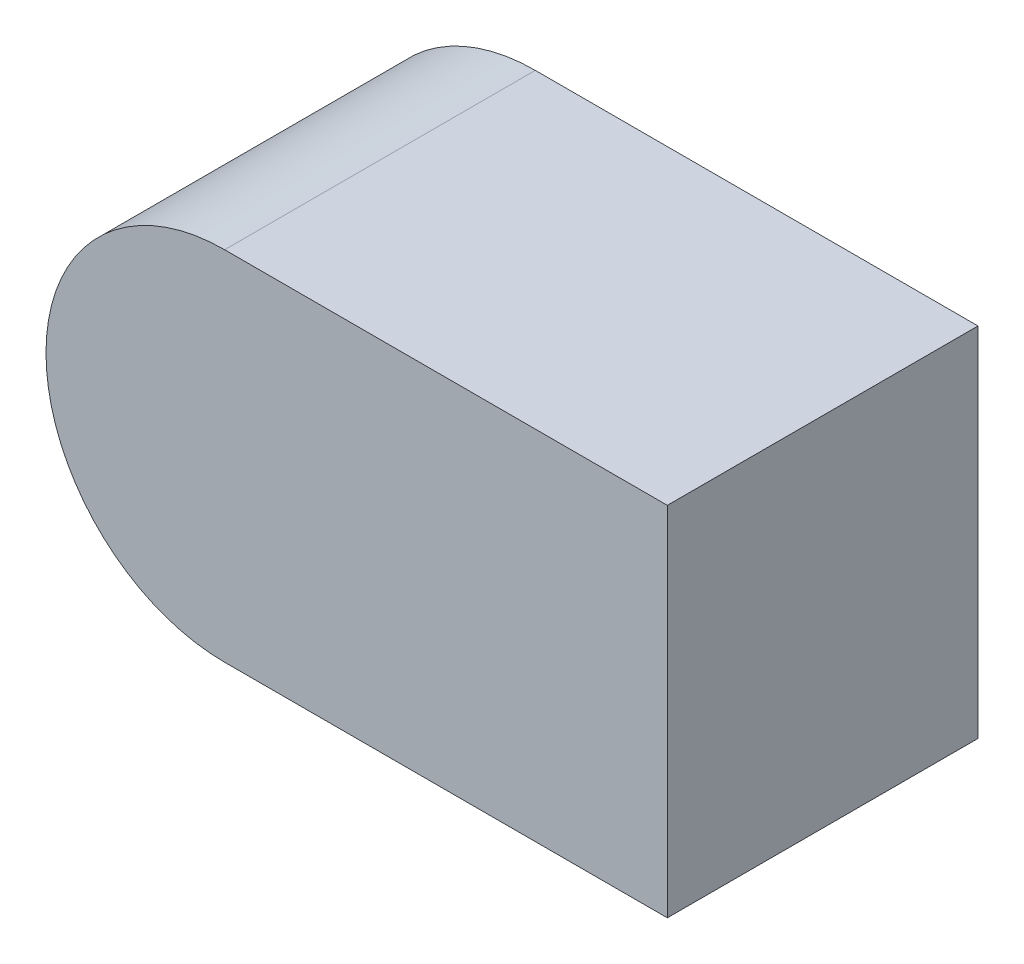
ISO-10303-21;
HEADER;
FILE_DESCRIPTION(('STEP AP214'),'2;1');
FILE_NAME('part.step','',(''),(''),'','','');
FILE_SCHEMA(('AUTOMOTIVE_DESIGN { 1 0 10303 214 1 1 1 1 }'));
ENDSEC;
DATA;
#1=APPLICATION_CONTEXT('core data for automotive mechanical design processes');
#2=APPLICATION_PROTOCOL_DEFINITION('international standard','automotive_design',2000,#1);
#3=PRODUCT_CONTEXT('',#1,'mechanical');
#4=PRODUCT('Part','Part','',(#3));
#5=PRODUCT_RELATED_PRODUCT_CATEGORY('part','',(#4));
#6=PRODUCT_DEFINITION_FORMATION('','',#4);
#7=PRODUCT_DEFINITION_CONTEXT('part definition',#1,'design');
#8=PRODUCT_DEFINITION('design','',#6,#7);
#9=PRODUCT_DEFINITION_SHAPE('','',#8);
#10=(LENGTH_UNIT() NAMED_UNIT(*) SI_UNIT(.MILLI.,.METRE.));
#11=(NAMED_UNIT(*) PLANE_ANGLE_UNIT() SI_UNIT($,.RADIAN.));
#12=(NAMED_UNIT(*) SI_UNIT($,.STERADIAN.) SOLID_ANGLE_UNIT());
#13=UNCERTAINTY_MEASURE_WITH_UNIT(LENGTH_MEASURE(1.E-05),#10,'distance_accuracy_value','');
#14=(GEOMETRIC_REPRESENTATION_CONTEXT(3) GLOBAL_UNCERTAINTY_ASSIGNED_CONTEXT((#13)) GLOBAL_UNIT_ASSIGNED_CONTEXT((#10,
#11,#12)) REPRESENTATION_CONTEXT('',''));
#15=CARTESIAN_POINT('',(0.,0.,0.));
#16=DIRECTION('',(0.,0.,1.));
#17=DIRECTION('',(1.,0.,0.));
#18=AXIS2_PLACEMENT_3D('',#15,#16,#17);
#19=CARTESIAN_POINT('',(2.8335265642716,-1.75,0.));
#20=DIRECTION('',(0.,0.,1.));
#21=DIRECTION('',(-1.,0.,0.));
#22=AXIS2_PLACEMENT_3D('',#19,#20,#21);
#23=PLANE('',#22);
#24=DIRECTION('',(0.,1.,0.));
#25=VECTOR('',#24,1.);
#26=CARTESIAN_POINT('',(3.,-1.865,0.));
#27=LINE('',#26,#25);
#28=CARTESIAN_POINT('',(3.,-1.865,0.));
#29=VERTEX_POINT('',#28);
#30=CARTESIAN_POINT('',(3.,-1.635,0.));
#31=VERTEX_POINT('',#30);
#32=EDGE_CURVE('E11',#29,#31,#27,.T.);
#33=ORIENTED_EDGE('',*,*,#32,.F.);
#34=DIRECTION('',(1.,0.,0.));
#35=VECTOR('',#34,1.);
#36=CARTESIAN_POINT('',(2.715,-1.865,0.));
#37=LINE('',#36,#35);
#38=CARTESIAN_POINT('',(2.715,-1.865,0.));
#39=VERTEX_POINT('',#38);
#40=EDGE_CURVE('E24',#39,#29,#37,.T.);
#41=ORIENTED_EDGE('',*,*,#40,.F.);
#42=CARTESIAN_POINT('',(2.715,-1.75,0.));
#43=DIRECTION('',(0.,0.,1.));
#44=DIRECTION('',(0.,1.,0.));
#45=AXIS2_PLACEMENT_3D('',#42,#43,#44);
#46=CIRCLE('',#45,0.115);
#47=CARTESIAN_POINT('',(2.715,-1.635,0.));
#48=VERTEX_POINT('',#47);
#49=EDGE_CURVE('E85',#48,#39,#46,.T.);
#50=ORIENTED_EDGE('',*,*,#49,.F.);
#51=DIRECTION('',(-1.,0.,0.));
#52=VECTOR('',#51,1.);
#53=CARTESIAN_POINT('',(3.,-1.635,0.));
#54=LINE('',#53,#52);
#55=EDGE_CURVE('E82',#31,#48,#54,.T.);
#56=ORIENTED_EDGE('',*,*,#55,.F.);
#57=EDGE_LOOP('',(#33,#41,#50,#56));
#58=FACE_BOUND('',#57,.T.);
#59=ADVANCED_FACE('F17',(#58),#23,.F.);
#60=CARTESIAN_POINT('',(3.,-1.635,0.));
#61=DIRECTION('',(0.,1.,0.));
#62=DIRECTION('',(-1.,0.,0.));
#63=AXIS2_PLACEMENT_3D('',#60,#61,#62);
#64=PLANE('',#63);
#65=ORIENTED_EDGE('',*,*,#55,.T.);
#66=DIRECTION('',(0.,0.,1.));
#67=VECTOR('',#66,1.);
#68=CARTESIAN_POINT('',(2.715,-1.635,0.));
#69=LINE('',#68,#67);
#70=CARTESIAN_POINT('',(2.715,-1.635,0.2));
#71=VERTEX_POINT('',#70);
#72=EDGE_CURVE('E80',#48,#71,#69,.T.);
#73=ORIENTED_EDGE('',*,*,#72,.T.);
#74=DIRECTION('',(-1.,0.,0.));
#75=VECTOR('',#74,1.);
#76=CARTESIAN_POINT('',(3.,-1.635,0.2));
#77=LINE('',#76,#75);
#78=CARTESIAN_POINT('',(3.,-1.635,0.2));
#79=VERTEX_POINT('',#78);
#80=EDGE_CURVE('E78',#79,#71,#77,.T.);
#81=ORIENTED_EDGE('',*,*,#80,.F.);
#82=DIRECTION('',(0.,0.,-1.));
#83=VECTOR('',#82,1.);
#84=CARTESIAN_POINT('',(3.,-1.635,0.));
#85=LINE('',#84,#83);
#86=EDGE_CURVE('E71',#79,#31,#85,.T.);
#87=ORIENTED_EDGE('',*,*,#86,.T.);
#88=EDGE_LOOP('',(#65,#73,#81,#87));
#89=FACE_BOUND('',#88,.T.);
#90=ADVANCED_FACE('F91',(#89),#64,.T.);
#91=CARTESIAN_POINT('',(2.715,-1.75,0.));
#92=DIRECTION('',(0.,0.,1.));
#93=DIRECTION('',(0.,1.,0.));
#94=AXIS2_PLACEMENT_3D('',#91,#92,#93);
#95=CYLINDRICAL_SURFACE('',#94,0.115);
#96=ORIENTED_EDGE('',*,*,#49,.T.);
#97=DIRECTION('',(0.,0.,1.));
#98=VECTOR('',#97,1.);
#99=CARTESIAN_POINT('',(2.715,-1.865,0.));
#100=LINE('',#99,#98);
#101=CARTESIAN_POINT('',(2.715,-1.865,0.2));
#102=VERTEX_POINT('',#101);
#103=EDGE_CURVE('E75',#39,#102,#100,.T.);
#104=ORIENTED_EDGE('',*,*,#103,.T.);
#105=CARTESIAN_POINT('',(2.715,-1.75,0.2));
#106=DIRECTION('',(0.,0.,1.));
#107=DIRECTION('',(0.,1.,0.));
#108=AXIS2_PLACEMENT_3D('',#105,#106,#107);
#109=CIRCLE('',#108,0.115);
#110=EDGE_CURVE('E59',#71,#102,#109,.T.);
#111=ORIENTED_EDGE('',*,*,#110,.F.);
#112=ORIENTED_EDGE('',*,*,#72,.F.);
#113=EDGE_LOOP('',(#96,#104,#111,#112));
#114=FACE_BOUND('',#113,.T.);
#115=ADVANCED_FACE('F89',(#114),#95,.T.);
#116=CARTESIAN_POINT('',(2.715,-1.865,0.));
#117=DIRECTION('',(0.,-1.,0.));
#118=DIRECTION('',(1.,0.,0.));
#119=AXIS2_PLACEMENT_3D('',#116,#117,#118);
#120=PLANE('',#119);
#121=ORIENTED_EDGE('',*,*,#40,.T.);
#122=DIRECTION('',(0.,0.,1.));
#123=VECTOR('',#122,1.);
#124=CARTESIAN_POINT('',(3.,-1.865,0.));
#125=LINE('',#124,#123);
#126=CARTESIAN_POINT('',(3.,-1.865,0.2));
#127=VERTEX_POINT('',#126);
#128=EDGE_CURVE('E53',#29,#127,#125,.T.);
#129=ORIENTED_EDGE('',*,*,#128,.T.);
#130=DIRECTION('',(1.,0.,0.));
#131=VECTOR('',#130,1.);
#132=CARTESIAN_POINT('',(2.715,-1.865,0.2));
#133=LINE('',#132,#131);
#134=EDGE_CURVE('E57',#102,#127,#133,.T.);
#135=ORIENTED_EDGE('',*,*,#134,.F.);
#136=ORIENTED_EDGE('',*,*,#103,.F.);
#137=EDGE_LOOP('',(#121,#129,#135,#136));
#138=FACE_BOUND('',#137,.T.);
#139=ADVANCED_FACE('F55',(#138),#120,.T.);
#140=CARTESIAN_POINT('',(3.,-3.,0.));
#141=DIRECTION('',(1.,0.,0.));
#142=DIRECTION('',(0.,1.,0.));
#143=AXIS2_PLACEMENT_3D('',#140,#141,#142);
#144=PLANE('',#143);
#145=ORIENTED_EDGE('',*,*,#86,.F.);
#146=DIRECTION('',(0.,1.,0.));
#147=VECTOR('',#146,1.);
#148=CARTESIAN_POINT('',(3.,-2.375,0.2));
#149=LINE('',#148,#147);
#150=EDGE_CURVE('E66',#127,#79,#149,.T.);
#151=ORIENTED_EDGE('',*,*,#150,.F.);
#152=ORIENTED_EDGE('',*,*,#128,.F.);
#153=ORIENTED_EDGE('',*,*,#32,.T.);
#154=EDGE_LOOP('',(#145,#151,#152,#153));
#155=FACE_BOUND('',#154,.T.);
#156=ADVANCED_FACE('F69',(#155),#144,.T.);
#157=CARTESIAN_POINT('',(2.8335240809167,-1.75,0.2));
#158=DIRECTION('',(0.,0.,1.));
#159=DIRECTION('',(1.,0.,0.));
#160=AXIS2_PLACEMENT_3D('',#157,#158,#159);
#161=PLANE('',#160);
#162=ORIENTED_EDGE('',*,*,#134,.T.);
#163=ORIENTED_EDGE('',*,*,#150,.T.);
#164=ORIENTED_EDGE('',*,*,#80,.T.);
#165=ORIENTED_EDGE('',*,*,#110,.T.);
#166=EDGE_LOOP('',(#162,#163,#164,#165));
#167=FACE_BOUND('',#166,.T.);
#168=ADVANCED_FACE('F64',(#167),#161,.T.);
#169=CLOSED_SHELL('',(#59,#90,#115,#139,#156,#168));
#170=MANIFOLD_SOLID_BREP('B1',#169);
#171=ADVANCED_BREP_SHAPE_REPRESENTATION('',(#18,#170),#14);
#172=SHAPE_DEFINITION_REPRESENTATION(#9,#171);
ENDSEC;
END-ISO-10303-21;
